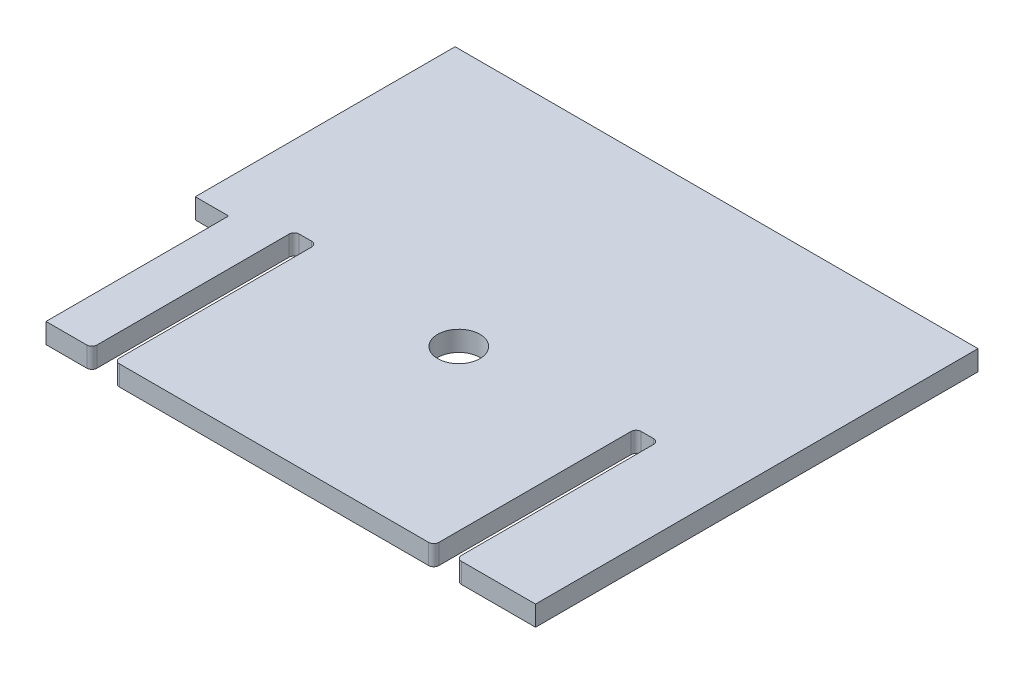
ISO-10303-21;
HEADER;
FILE_DESCRIPTION(('STEP AP214'),'2;1');
FILE_NAME('part.step','',(''),(''),'','','');
FILE_SCHEMA(('AUTOMOTIVE_DESIGN { 1 0 10303 214 1 1 1 1 }'));
ENDSEC;
DATA;
#1=APPLICATION_CONTEXT('core data for automotive mechanical design processes');
#2=APPLICATION_PROTOCOL_DEFINITION('international standard','automotive_design',2000,#1);
#3=PRODUCT_CONTEXT('',#1,'mechanical');
#4=PRODUCT('Part','Part','',(#3));
#5=PRODUCT_RELATED_PRODUCT_CATEGORY('part','',(#4));
#6=PRODUCT_DEFINITION_FORMATION('','',#4);
#7=PRODUCT_DEFINITION_CONTEXT('part definition',#1,'design');
#8=PRODUCT_DEFINITION('design','',#6,#7);
#9=PRODUCT_DEFINITION_SHAPE('','',#8);
#10=(LENGTH_UNIT() NAMED_UNIT(*) SI_UNIT(.MILLI.,.METRE.));
#11=(NAMED_UNIT(*) PLANE_ANGLE_UNIT() SI_UNIT($,.RADIAN.));
#12=(NAMED_UNIT(*) SI_UNIT($,.STERADIAN.) SOLID_ANGLE_UNIT());
#13=UNCERTAINTY_MEASURE_WITH_UNIT(LENGTH_MEASURE(1.E-05),#10,'distance_accuracy_value','');
#14=(GEOMETRIC_REPRESENTATION_CONTEXT(3) GLOBAL_UNCERTAINTY_ASSIGNED_CONTEXT((#13)) GLOBAL_UNIT_ASSIGNED_CONTEXT((#10,
#11,#12)) REPRESENTATION_CONTEXT('',''));
#15=CARTESIAN_POINT('',(0.,0.,0.));
#16=DIRECTION('',(0.,0.,1.));
#17=DIRECTION('',(1.,0.,0.));
#18=AXIS2_PLACEMENT_3D('',#15,#16,#17);
#19=CARTESIAN_POINT('',(799.161999999964,311.15,0.));
#20=DIRECTION('',(1.,0.,0.));
#21=DIRECTION('',(0.,0.,-1.));
#22=AXIS2_PLACEMENT_3D('',#19,#20,#21);
#23=PLANE('',#22);
#24=DIRECTION('',(0.,0.,1.));
#25=VECTOR('',#24,1.);
#26=CARTESIAN_POINT('',(799.161999999964,298.45,0.));
#27=LINE('',#26,#25);
#28=CARTESIAN_POINT('',(799.161999999964,298.45,-257.937));
#29=VERTEX_POINT('',#28);
#30=CARTESIAN_POINT('',(799.161999999964,298.45,-136.525));
#31=VERTEX_POINT('',#30);
#32=EDGE_CURVE('E270',#29,#31,#27,.T.);
#33=ORIENTED_EDGE('',*,*,#32,.T.);
#34=DIRECTION('',(0.,-1.,0.));
#35=VECTOR('',#34,1.);
#36=CARTESIAN_POINT('',(799.161999999964,311.15,-136.525));
#37=LINE('',#36,#35);
#38=CARTESIAN_POINT('',(799.161999999964,311.15,-136.525));
#39=VERTEX_POINT('',#38);
#40=EDGE_CURVE('E390',#31,#39,#37,.F.);
#41=ORIENTED_EDGE('',*,*,#40,.T.);
#42=DIRECTION('',(0.,0.,1.));
#43=VECTOR('',#42,1.);
#44=CARTESIAN_POINT('',(799.161999999964,311.15,0.));
#45=LINE('',#44,#43);
#46=CARTESIAN_POINT('',(799.161999999964,311.15,-257.937));
#47=VERTEX_POINT('',#46);
#48=EDGE_CURVE('E300',#47,#39,#45,.T.);
#49=ORIENTED_EDGE('',*,*,#48,.F.);
#50=DIRECTION('',(0.,-1.,0.));
#51=VECTOR('',#50,1.);
#52=CARTESIAN_POINT('',(799.161999999964,311.15,-257.937));
#53=LINE('',#52,#51);
#54=EDGE_CURVE('E386',#47,#29,#53,.T.);
#55=ORIENTED_EDGE('',*,*,#54,.T.);
#56=EDGE_LOOP('',(#33,#41,#49,#55));
#57=FACE_BOUND('',#56,.T.);
#58=ADVANCED_FACE('F46',(#57),#23,.F.);
#59=CARTESIAN_POINT('',(0.,311.15,-133.35));
#60=DIRECTION('',(0.,0.,1.));
#61=DIRECTION('',(1.,0.,0.));
#62=AXIS2_PLACEMENT_3D('',#59,#60,#61);
#63=PLANE('',#62);
#64=DIRECTION('',(-1.,0.,0.));
#65=VECTOR('',#64,1.);
#66=CARTESIAN_POINT('',(0.,298.45,-133.35));
#67=LINE('',#66,#65);
#68=CARTESIAN_POINT('',(997.662999999964,298.45,-133.35));
#69=VERTEX_POINT('',#68);
#70=CARTESIAN_POINT('',(802.336999999964,298.45,-133.35));
#71=VERTEX_POINT('',#70);
#72=EDGE_CURVE('E250',#69,#71,#67,.T.);
#73=ORIENTED_EDGE('',*,*,#72,.F.);
#74=DIRECTION('',(0.,-1.,0.));
#75=VECTOR('',#74,1.);
#76=CARTESIAN_POINT('',(997.662999999964,311.15,-133.35));
#77=LINE('',#76,#75);
#78=CARTESIAN_POINT('',(997.662999999964,311.15,-133.35));
#79=VERTEX_POINT('',#78);
#80=EDGE_CURVE('E383',#69,#79,#77,.F.);
#81=ORIENTED_EDGE('',*,*,#80,.T.);
#82=DIRECTION('',(-1.,0.,0.));
#83=VECTOR('',#82,1.);
#84=CARTESIAN_POINT('',(0.,311.15,-133.35));
#85=LINE('',#84,#83);
#86=CARTESIAN_POINT('',(802.336999999964,311.15,-133.35));
#87=VERTEX_POINT('',#86);
#88=EDGE_CURVE('E265',#79,#87,#85,.T.);
#89=ORIENTED_EDGE('',*,*,#88,.T.);
#90=DIRECTION('',(0.,-1.,0.));
#91=VECTOR('',#90,1.);
#92=CARTESIAN_POINT('',(802.336999999964,298.45,-133.35));
#93=LINE('',#92,#91);
#94=EDGE_CURVE('E379',#87,#71,#93,.T.);
#95=ORIENTED_EDGE('',*,*,#94,.T.);
#96=EDGE_LOOP('',(#73,#81,#89,#95));
#97=FACE_BOUND('',#96,.T.);
#98=ADVANCED_FACE('F456',(#97),#63,.T.);
#99=CARTESIAN_POINT('',(1000.83799999996,311.15,0.));
#100=DIRECTION('',(-1.,0.,0.));
#101=DIRECTION('',(0.,0.,1.));
#102=AXIS2_PLACEMENT_3D('',#99,#100,#101);
#103=PLANE('',#102);
#104=DIRECTION('',(0.,0.,-1.));
#105=VECTOR('',#104,1.);
#106=CARTESIAN_POINT('',(1000.83799999996,311.15,0.));
#107=LINE('',#106,#105);
#108=CARTESIAN_POINT('',(1000.83799999996,311.15,-136.525));
#109=VERTEX_POINT('',#108);
#110=CARTESIAN_POINT('',(1000.83799999996,311.15,-257.937));
#111=VERTEX_POINT('',#110);
#112=EDGE_CURVE('E297',#109,#111,#107,.T.);
#113=ORIENTED_EDGE('',*,*,#112,.F.);
#114=DIRECTION('',(0.,-1.,0.));
#115=VECTOR('',#114,1.);
#116=CARTESIAN_POINT('',(1000.83799999996,298.45,-136.525));
#117=LINE('',#116,#115);
#118=CARTESIAN_POINT('',(1000.83799999996,298.45,-136.525));
#119=VERTEX_POINT('',#118);
#120=EDGE_CURVE('E375',#109,#119,#117,.T.);
#121=ORIENTED_EDGE('',*,*,#120,.T.);
#122=DIRECTION('',(0.,0.,-1.));
#123=VECTOR('',#122,1.);
#124=CARTESIAN_POINT('',(1000.83799999996,298.45,0.));
#125=LINE('',#124,#123);
#126=CARTESIAN_POINT('',(1000.83799999996,298.45,-257.937));
#127=VERTEX_POINT('',#126);
#128=EDGE_CURVE('E269',#119,#127,#125,.T.);
#129=ORIENTED_EDGE('',*,*,#128,.T.);
#130=DIRECTION('',(0.,-1.,0.));
#131=VECTOR('',#130,1.);
#132=CARTESIAN_POINT('',(1000.83799999996,311.15,-257.937));
#133=LINE('',#132,#131);
#134=EDGE_CURVE('E372',#127,#111,#133,.F.);
#135=ORIENTED_EDGE('',*,*,#134,.T.);
#136=EDGE_LOOP('',(#113,#121,#129,#135));
#137=FACE_BOUND('',#136,.T.);
#138=ADVANCED_FACE('F463',(#137),#103,.F.);
#139=CARTESIAN_POINT('',(-2.28261853862925E-12,311.15,-261.111999999991));
#140=DIRECTION('',(0.,0.,1.));
#141=DIRECTION('',(1.,0.,0.));
#142=AXIS2_PLACEMENT_3D('',#139,#140,#141);
#143=PLANE('',#142);
#144=DIRECTION('',(-1.,0.,0.));
#145=VECTOR('',#144,1.);
#146=CARTESIAN_POINT('',(-2.28261853862925E-12,311.15,-261.111999999991));
#147=LINE('',#146,#145);
#148=CARTESIAN_POINT('',(1011.88699999996,311.15,-261.112));
#149=VERTEX_POINT('',#148);
#150=CARTESIAN_POINT('',(1004.01299999996,311.15,-261.112));
#151=VERTEX_POINT('',#150);
#152=EDGE_CURVE('E296',#149,#151,#147,.T.);
#153=ORIENTED_EDGE('',*,*,#152,.T.);
#154=DIRECTION('',(0.,-1.,0.));
#155=VECTOR('',#154,1.);
#156=CARTESIAN_POINT('',(1004.01299999996,311.15,-261.112));
#157=LINE('',#156,#155);
#158=CARTESIAN_POINT('',(1004.01299999996,298.45,-261.112));
#159=VERTEX_POINT('',#158);
#160=EDGE_CURVE('E405',#151,#159,#157,.T.);
#161=ORIENTED_EDGE('',*,*,#160,.T.);
#162=DIRECTION('',(-1.,0.,0.));
#163=VECTOR('',#162,1.);
#164=CARTESIAN_POINT('',(-2.28261853862925E-12,298.45,-261.111999999991));
#165=LINE('',#164,#163);
#166=CARTESIAN_POINT('',(1011.88699999996,298.45,-261.112));
#167=VERTEX_POINT('',#166);
#168=EDGE_CURVE('E254',#167,#159,#165,.T.);
#169=ORIENTED_EDGE('',*,*,#168,.F.);
#170=DIRECTION('',(0.,-1.,0.));
#171=VECTOR('',#170,1.);
#172=CARTESIAN_POINT('',(1011.88699999996,311.15,-261.112));
#173=LINE('',#172,#171);
#174=EDGE_CURVE('E69',#167,#149,#173,.F.);
#175=ORIENTED_EDGE('',*,*,#174,.T.);
#176=EDGE_LOOP('',(#153,#161,#169,#175));
#177=FACE_BOUND('',#176,.T.);
#178=ADVANCED_FACE('F469',(#177),#143,.T.);
#179=CARTESIAN_POINT('',(1015.06199999996,311.15,0.));
#180=DIRECTION('',(1.,0.,0.));
#181=DIRECTION('',(0.,0.,-1.));
#182=AXIS2_PLACEMENT_3D('',#179,#180,#181);
#183=PLANE('',#182);
#184=DIRECTION('',(0.,0.,1.));
#185=VECTOR('',#184,1.);
#186=CARTESIAN_POINT('',(1015.06199999996,298.45,0.));
#187=LINE('',#186,#185);
#188=CARTESIAN_POINT('',(1015.06199999996,298.45,-257.937));
#189=VERTEX_POINT('',#188);
#190=CARTESIAN_POINT('',(1015.06199999996,298.45,-136.525));
#191=VERTEX_POINT('',#190);
#192=EDGE_CURVE('E275',#189,#191,#187,.T.);
#193=ORIENTED_EDGE('',*,*,#192,.T.);
#194=DIRECTION('',(0.,-1.,0.));
#195=VECTOR('',#194,1.);
#196=CARTESIAN_POINT('',(1015.06199999996,311.15,-136.525));
#197=LINE('',#196,#195);
#198=CARTESIAN_POINT('',(1015.06199999996,311.15,-136.525));
#199=VERTEX_POINT('',#198);
#200=EDGE_CURVE('E357',#191,#199,#197,.F.);
#201=ORIENTED_EDGE('',*,*,#200,.T.);
#202=DIRECTION('',(0.,0.,1.));
#203=VECTOR('',#202,1.);
#204=CARTESIAN_POINT('',(1015.06199999996,311.15,0.));
#205=LINE('',#204,#203);
#206=CARTESIAN_POINT('',(1015.06199999996,311.15,-257.937));
#207=VERTEX_POINT('',#206);
#208=EDGE_CURVE('E283',#207,#199,#205,.T.);
#209=ORIENTED_EDGE('',*,*,#208,.F.);
#210=DIRECTION('',(0.,-1.,0.));
#211=VECTOR('',#210,1.);
#212=CARTESIAN_POINT('',(1015.06199999996,311.15,-257.937));
#213=LINE('',#212,#211);
#214=EDGE_CURVE('E353',#207,#189,#213,.T.);
#215=ORIENTED_EDGE('',*,*,#214,.T.);
#216=EDGE_LOOP('',(#193,#201,#209,#215));
#217=FACE_BOUND('',#216,.T.);
#218=ADVANCED_FACE('F477',(#217),#183,.F.);
#219=CARTESIAN_POINT('',(0.,311.15,-133.35));
#220=DIRECTION('',(0.,0.,1.));
#221=DIRECTION('',(1.,0.,0.));
#222=AXIS2_PLACEMENT_3D('',#219,#220,#221);
#223=PLANE('',#222);
#224=DIRECTION('',(-1.,0.,0.));
#225=VECTOR('',#224,1.);
#226=CARTESIAN_POINT('',(0.,311.15,-133.35));
#227=LINE('',#226,#225);
#228=CARTESIAN_POINT('',(1065.09999999996,311.15,-133.35));
#229=VERTEX_POINT('',#228);
#230=CARTESIAN_POINT('',(1018.23699999996,311.15,-133.35));
#231=VERTEX_POINT('',#230);
#232=EDGE_CURVE('E271',#229,#231,#227,.T.);
#233=ORIENTED_EDGE('',*,*,#232,.T.);
#234=DIRECTION('',(0.,-1.,0.));
#235=VECTOR('',#234,1.);
#236=CARTESIAN_POINT('',(1018.23699999996,298.45,-133.35));
#237=LINE('',#236,#235);
#238=CARTESIAN_POINT('',(1018.23699999996,298.45,-133.35));
#239=VERTEX_POINT('',#238);
#240=EDGE_CURVE('E338',#231,#239,#237,.T.);
#241=ORIENTED_EDGE('',*,*,#240,.T.);
#242=DIRECTION('',(-1.,0.,0.));
#243=VECTOR('',#242,1.);
#244=CARTESIAN_POINT('',(0.,298.45,-133.35));
#245=LINE('',#244,#243);
#246=CARTESIAN_POINT('',(1065.09999999996,298.45,-133.35));
#247=VERTEX_POINT('',#246);
#248=EDGE_CURVE('E255',#247,#239,#245,.T.);
#249=ORIENTED_EDGE('',*,*,#248,.F.);
#250=DIRECTION('',(0.,-1.,0.));
#251=VECTOR('',#250,1.);
#252=CARTESIAN_POINT('',(1065.09999999996,311.15,-133.35));
#253=LINE('',#252,#251);
#254=EDGE_CURVE('E246',#229,#247,#253,.T.);
#255=ORIENTED_EDGE('',*,*,#254,.F.);
#256=EDGE_LOOP('',(#233,#241,#249,#255));
#257=FACE_BOUND('',#256,.T.);
#258=ADVANCED_FACE('F486',(#257),#223,.T.);
#259=CARTESIAN_POINT('',(1065.09999999996,311.15,0.));
#260=DIRECTION('',(1.,0.,0.));
#261=DIRECTION('',(0.,0.,-1.));
#262=AXIS2_PLACEMENT_3D('',#259,#260,#261);
#263=PLANE('',#262);
#264=DIRECTION('',(0.,0.,1.));
#265=VECTOR('',#264,1.);
#266=CARTESIAN_POINT('',(1065.09999999996,298.45,0.));
#267=LINE('',#266,#265);
#268=CARTESIAN_POINT('',(1065.09999999996,298.45,-412.75));
#269=VERTEX_POINT('',#268);
#270=EDGE_CURVE('E258',#269,#247,#267,.T.);
#271=ORIENTED_EDGE('',*,*,#270,.F.);
#272=DIRECTION('',(0.,-1.,0.));
#273=VECTOR('',#272,1.);
#274=CARTESIAN_POINT('',(1065.09999999996,311.15,-412.75));
#275=LINE('',#274,#273);
#276=CARTESIAN_POINT('',(1065.09999999996,311.15,-412.75));
#277=VERTEX_POINT('',#276);
#278=EDGE_CURVE('E242',#277,#269,#275,.T.);
#279=ORIENTED_EDGE('',*,*,#278,.F.);
#280=DIRECTION('',(0.,0.,1.));
#281=VECTOR('',#280,1.);
#282=CARTESIAN_POINT('',(1065.09999999996,311.15,0.));
#283=LINE('',#282,#281);
#284=EDGE_CURVE('E249',#277,#229,#283,.T.);
#285=ORIENTED_EDGE('',*,*,#284,.T.);
#286=ORIENTED_EDGE('',*,*,#254,.T.);
#287=EDGE_LOOP('',(#271,#279,#285,#286));
#288=FACE_BOUND('',#287,.T.);
#289=ADVANCED_FACE('F491',(#288),#263,.T.);
#290=CARTESIAN_POINT('',(1.80411241501589E-12,311.15,-412.750000000003));
#291=DIRECTION('',(0.,0.,1.));
#292=DIRECTION('',(1.,0.,0.));
#293=AXIS2_PLACEMENT_3D('',#290,#291,#292);
#294=PLANE('',#293);
#295=DIRECTION('',(-1.,0.,0.));
#296=VECTOR('',#295,1.);
#297=CARTESIAN_POINT('',(1.80411241501589E-12,298.45,-412.750000000003));
#298=LINE('',#297,#296);
#299=CARTESIAN_POINT('',(734.899999999964,298.45,-412.75));
#300=VERTEX_POINT('',#299);
#301=EDGE_CURVE('E245',#269,#300,#298,.T.);
#302=ORIENTED_EDGE('',*,*,#301,.T.);
#303=DIRECTION('',(0.,-1.,0.));
#304=VECTOR('',#303,1.);
#305=CARTESIAN_POINT('',(734.899999999964,311.15,-412.75));
#306=LINE('',#305,#304);
#307=CARTESIAN_POINT('',(734.899999999964,311.15,-412.75));
#308=VERTEX_POINT('',#307);
#309=EDGE_CURVE('E237',#308,#300,#306,.T.);
#310=ORIENTED_EDGE('',*,*,#309,.F.);
#311=DIRECTION('',(-1.,0.,0.));
#312=VECTOR('',#311,1.);
#313=CARTESIAN_POINT('',(1.80411241501589E-12,311.15,-412.750000000003));
#314=LINE('',#313,#312);
#315=EDGE_CURVE('E279',#277,#308,#314,.T.);
#316=ORIENTED_EDGE('',*,*,#315,.F.);
#317=ORIENTED_EDGE('',*,*,#278,.T.);
#318=EDGE_LOOP('',(#302,#310,#316,#317));
#319=FACE_BOUND('',#318,.T.);
#320=ADVANCED_FACE('F498',(#319),#294,.F.);
#321=CARTESIAN_POINT('',(734.899999999964,311.15,0.));
#322=DIRECTION('',(1.,0.,0.));
#323=DIRECTION('',(0.,0.,-1.));
#324=AXIS2_PLACEMENT_3D('',#321,#322,#323);
#325=PLANE('',#324);
#326=DIRECTION('',(0.,0.,1.));
#327=VECTOR('',#326,1.);
#328=CARTESIAN_POINT('',(734.899999999964,298.45,0.));
#329=LINE('',#328,#327);
#330=CARTESIAN_POINT('',(734.899999999964,298.45,-248.675364530192));
#331=VERTEX_POINT('',#330);
#332=EDGE_CURVE('E241',#300,#331,#329,.T.);
#333=ORIENTED_EDGE('',*,*,#332,.T.);
#334=DIRECTION('',(0.,1.,0.));
#335=VECTOR('',#334,1.);
#336=CARTESIAN_POINT('',(734.899999999964,298.45,-248.675364530192));
#337=LINE('',#336,#335);
#338=CARTESIAN_POINT('',(734.899999999964,311.15,-248.675364530192));
#339=VERTEX_POINT('',#338);
#340=EDGE_CURVE('E232',#331,#339,#337,.T.);
#341=ORIENTED_EDGE('',*,*,#340,.T.);
#342=DIRECTION('',(0.,0.,1.));
#343=VECTOR('',#342,1.);
#344=CARTESIAN_POINT('',(734.899999999964,311.15,0.));
#345=LINE('',#344,#343);
#346=EDGE_CURVE('E282',#308,#339,#345,.T.);
#347=ORIENTED_EDGE('',*,*,#346,.F.);
#348=ORIENTED_EDGE('',*,*,#309,.T.);
#349=EDGE_LOOP('',(#333,#341,#347,#348));
#350=FACE_BOUND('',#349,.T.);
#351=ADVANCED_FACE('F501',(#350),#325,.F.);
#352=CARTESIAN_POINT('',(1.45716771982053E-13,311.15,-133.350000000001));
#353=DIRECTION('',(0.,0.,1.));
#354=DIRECTION('',(1.,0.,0.));
#355=AXIS2_PLACEMENT_3D('',#352,#353,#354);
#356=PLANE('',#355);
#357=DIRECTION('',(-1.,0.,0.));
#358=VECTOR('',#357,1.);
#359=CARTESIAN_POINT('',(1.45716771982053E-13,298.45,-133.350000000001));
#360=LINE('',#359,#358);
#361=CARTESIAN_POINT('',(781.762999999964,298.45,-133.35));
#362=VERTEX_POINT('',#361);
#363=CARTESIAN_POINT('',(755.968746235558,298.45,-133.35));
#364=VERTEX_POINT('',#363);
#365=EDGE_CURVE('E197',#362,#364,#360,.T.);
#366=ORIENTED_EDGE('',*,*,#365,.F.);
#367=DIRECTION('',(0.,-1.,0.));
#368=VECTOR('',#367,1.);
#369=CARTESIAN_POINT('',(781.762999999964,311.15,-133.35));
#370=LINE('',#369,#368);
#371=CARTESIAN_POINT('',(781.762999999964,311.15,-133.35));
#372=VERTEX_POINT('',#371);
#373=EDGE_CURVE('E400',#362,#372,#370,.F.);
#374=ORIENTED_EDGE('',*,*,#373,.T.);
#375=DIRECTION('',(-1.,0.,0.));
#376=VECTOR('',#375,1.);
#377=CARTESIAN_POINT('',(1.45716771982053E-13,311.15,-133.350000000001));
#378=LINE('',#377,#376);
#379=CARTESIAN_POINT('',(755.968746235558,311.15,-133.35));
#380=VERTEX_POINT('',#379);
#381=EDGE_CURVE('E227',#372,#380,#378,.T.);
#382=ORIENTED_EDGE('',*,*,#381,.T.);
#383=DIRECTION('',(0.,1.,0.));
#384=VECTOR('',#383,1.);
#385=CARTESIAN_POINT('',(755.968746235558,298.45,-133.35));
#386=LINE('',#385,#384);
#387=EDGE_CURVE('E218',#364,#380,#386,.T.);
#388=ORIENTED_EDGE('',*,*,#387,.F.);
#389=EDGE_LOOP('',(#366,#374,#382,#388));
#390=FACE_BOUND('',#389,.T.);
#391=ADVANCED_FACE('F225',(#390),#356,.T.);
#392=CARTESIAN_POINT('',(784.937999999964,311.15,0.));
#393=DIRECTION('',(-1.,0.,0.));
#394=DIRECTION('',(0.,0.,1.));
#395=AXIS2_PLACEMENT_3D('',#392,#393,#394);
#396=PLANE('',#395);
#397=DIRECTION('',(0.,0.,-1.));
#398=VECTOR('',#397,1.);
#399=CARTESIAN_POINT('',(784.937999999964,311.15,0.));
#400=LINE('',#399,#398);
#401=CARTESIAN_POINT('',(784.937999999964,311.15,-136.525));
#402=VERTEX_POINT('',#401);
#403=CARTESIAN_POINT('',(784.937999999964,311.15,-257.937));
#404=VERTEX_POINT('',#403);
#405=EDGE_CURVE('E316',#402,#404,#400,.T.);
#406=ORIENTED_EDGE('',*,*,#405,.F.);
#407=DIRECTION('',(0.,-1.,0.));
#408=VECTOR('',#407,1.);
#409=CARTESIAN_POINT('',(784.937999999964,298.45,-136.525));
#410=LINE('',#409,#408);
#411=CARTESIAN_POINT('',(784.937999999964,298.45,-136.525));
#412=VERTEX_POINT('',#411);
#413=EDGE_CURVE('E396',#402,#412,#410,.T.);
#414=ORIENTED_EDGE('',*,*,#413,.T.);
#415=DIRECTION('',(0.,0.,-1.));
#416=VECTOR('',#415,1.);
#417=CARTESIAN_POINT('',(784.937999999964,298.45,0.));
#418=LINE('',#417,#416);
#419=CARTESIAN_POINT('',(784.937999999964,298.45,-257.937));
#420=VERTEX_POINT('',#419);
#421=EDGE_CURVE('E286',#412,#420,#418,.T.);
#422=ORIENTED_EDGE('',*,*,#421,.T.);
#423=DIRECTION('',(0.,-1.,0.));
#424=VECTOR('',#423,1.);
#425=CARTESIAN_POINT('',(784.937999999964,311.15,-257.937));
#426=LINE('',#425,#424);
#427=EDGE_CURVE('E393',#420,#404,#426,.F.);
#428=ORIENTED_EDGE('',*,*,#427,.T.);
#429=EDGE_LOOP('',(#406,#414,#422,#428));
#430=FACE_BOUND('',#429,.T.);
#431=ADVANCED_FACE('F530',(#430),#396,.F.);
#432=CARTESIAN_POINT('',(0.,311.15,-261.112));
#433=DIRECTION('',(0.,0.,1.));
#434=DIRECTION('',(1.,0.,0.));
#435=AXIS2_PLACEMENT_3D('',#432,#433,#434);
#436=PLANE('',#435);
#437=DIRECTION('',(-1.,0.,0.));
#438=VECTOR('',#437,1.);
#439=CARTESIAN_POINT('',(0.,311.15,-261.112));
#440=LINE('',#439,#438);
#441=CARTESIAN_POINT('',(795.986999999964,311.15,-261.112));
#442=VERTEX_POINT('',#441);
#443=CARTESIAN_POINT('',(788.112999999964,311.15,-261.112));
#444=VERTEX_POINT('',#443);
#445=EDGE_CURVE('E315',#442,#444,#440,.T.);
#446=ORIENTED_EDGE('',*,*,#445,.T.);
#447=DIRECTION('',(0.,-1.,0.));
#448=VECTOR('',#447,1.);
#449=CARTESIAN_POINT('',(788.112999999964,311.15,-261.112));
#450=LINE('',#449,#448);
#451=CARTESIAN_POINT('',(788.112999999964,298.45,-261.112));
#452=VERTEX_POINT('',#451);
#453=EDGE_CURVE('E412',#444,#452,#450,.T.);
#454=ORIENTED_EDGE('',*,*,#453,.T.);
#455=DIRECTION('',(-1.,0.,0.));
#456=VECTOR('',#455,1.);
#457=CARTESIAN_POINT('',(0.,298.45,-261.112));
#458=LINE('',#457,#456);
#459=CARTESIAN_POINT('',(795.986999999964,298.45,-261.112));
#460=VERTEX_POINT('',#459);
#461=EDGE_CURVE('E211',#460,#452,#458,.T.);
#462=ORIENTED_EDGE('',*,*,#461,.F.);
#463=DIRECTION('',(0.,-1.,0.));
#464=VECTOR('',#463,1.);
#465=CARTESIAN_POINT('',(795.986999999964,311.15,-261.112));
#466=LINE('',#465,#464);
#467=EDGE_CURVE('E409',#460,#442,#466,.F.);
#468=ORIENTED_EDGE('',*,*,#467,.T.);
#469=EDGE_LOOP('',(#446,#454,#462,#468));
#470=FACE_BOUND('',#469,.T.);
#471=ADVANCED_FACE('F439',(#470),#436,.T.);
#472=CARTESIAN_POINT('',(0.,311.15,0.));
#473=DIRECTION('',(0.,-1.,0.));
#474=DIRECTION('',(0.,0.,-1.));
#475=AXIS2_PLACEMENT_3D('',#472,#473,#474);
#476=PLANE('',#475);
#477=ORIENTED_EDGE('',*,*,#208,.T.);
#478=CARTESIAN_POINT('',(1018.23699999996,311.15,-136.525));
#479=DIRECTION('',(0.,-1.,0.));
#480=DIRECTION('',(0.,0.,-1.));
#481=AXIS2_PLACEMENT_3D('',#478,#479,#480);
#482=CIRCLE('',#481,3.175);
#483=EDGE_CURVE('E369',#199,#231,#482,.F.);
#484=ORIENTED_EDGE('',*,*,#483,.T.);
#485=ORIENTED_EDGE('',*,*,#232,.F.);
#486=ORIENTED_EDGE('',*,*,#284,.F.);
#487=ORIENTED_EDGE('',*,*,#315,.T.);
#488=ORIENTED_EDGE('',*,*,#346,.T.);
#489=DIRECTION('',(-1.,0.,0.));
#490=VECTOR('',#489,1.);
#491=CARTESIAN_POINT('',(734.899999999964,311.15,-248.675364530192));
#492=LINE('',#491,#490);
#493=CARTESIAN_POINT('',(755.968746235558,311.15,-248.675364530192));
#494=VERTEX_POINT('',#493);
#495=EDGE_CURVE('E223',#494,#339,#492,.T.);
#496=ORIENTED_EDGE('',*,*,#495,.F.);
#497=DIRECTION('',(0.,0.,-1.));
#498=VECTOR('',#497,1.);
#499=CARTESIAN_POINT('',(755.968746235558,311.15,-133.35));
#500=LINE('',#499,#498);
#501=EDGE_CURVE('E507',#380,#494,#500,.T.);
#502=ORIENTED_EDGE('',*,*,#501,.F.);
#503=ORIENTED_EDGE('',*,*,#381,.F.);
#504=CARTESIAN_POINT('',(781.762999999964,311.15,-136.525));
#505=DIRECTION('',(0.,-1.,0.));
#506=DIRECTION('',(0.,0.,-1.));
#507=AXIS2_PLACEMENT_3D('',#504,#505,#506);
#508=CIRCLE('',#507,3.175);
#509=EDGE_CURVE('E360',#372,#402,#508,.F.);
#510=ORIENTED_EDGE('',*,*,#509,.T.);
#511=ORIENTED_EDGE('',*,*,#405,.T.);
#512=CARTESIAN_POINT('',(788.112999999964,311.15,-257.937));
#513=DIRECTION('',(0.,-1.,0.));
#514=DIRECTION('',(0.,0.,-1.));
#515=AXIS2_PLACEMENT_3D('',#512,#513,#514);
#516=CIRCLE('',#515,3.175);
#517=EDGE_CURVE('E430',#404,#444,#516,.T.);
#518=ORIENTED_EDGE('',*,*,#517,.T.);
#519=ORIENTED_EDGE('',*,*,#445,.F.);
#520=CARTESIAN_POINT('',(795.986999999964,311.15,-257.937));
#521=DIRECTION('',(0.,-1.,0.));
#522=DIRECTION('',(0.,0.,-1.));
#523=AXIS2_PLACEMENT_3D('',#520,#521,#522);
#524=CIRCLE('',#523,3.175);
#525=EDGE_CURVE('E12',#442,#47,#524,.T.);
#526=ORIENTED_EDGE('',*,*,#525,.T.);
#527=ORIENTED_EDGE('',*,*,#48,.T.);
#528=CARTESIAN_POINT('',(802.336999999964,311.15,-136.525));
#529=DIRECTION('',(0.,-1.,0.));
#530=DIRECTION('',(0.,0.,-1.));
#531=AXIS2_PLACEMENT_3D('',#528,#529,#530);
#532=CIRCLE('',#531,3.175);
#533=EDGE_CURVE('E363',#39,#87,#532,.F.);
#534=ORIENTED_EDGE('',*,*,#533,.T.);
#535=ORIENTED_EDGE('',*,*,#88,.F.);
#536=CARTESIAN_POINT('',(997.662999999964,311.15,-136.525));
#537=DIRECTION('',(0.,-1.,0.));
#538=DIRECTION('',(0.,0.,-1.));
#539=AXIS2_PLACEMENT_3D('',#536,#537,#538);
#540=CIRCLE('',#539,3.175);
#541=EDGE_CURVE('E366',#79,#109,#540,.F.);
#542=ORIENTED_EDGE('',*,*,#541,.T.);
#543=ORIENTED_EDGE('',*,*,#112,.T.);
#544=CARTESIAN_POINT('',(1004.01299999996,311.15,-257.937));
#545=DIRECTION('',(0.,-1.,0.));
#546=DIRECTION('',(0.,0.,-1.));
#547=AXIS2_PLACEMENT_3D('',#544,#545,#546);
#548=CIRCLE('',#547,3.175);
#549=EDGE_CURVE('E62',#111,#151,#548,.T.);
#550=ORIENTED_EDGE('',*,*,#549,.T.);
#551=ORIENTED_EDGE('',*,*,#152,.F.);
#552=CARTESIAN_POINT('',(1011.88699999996,311.15,-257.937));
#553=DIRECTION('',(0.,-1.,0.));
#554=DIRECTION('',(0.,0.,-1.));
#555=AXIS2_PLACEMENT_3D('',#552,#553,#554);
#556=CIRCLE('',#555,3.175);
#557=EDGE_CURVE('E424',#149,#207,#556,.T.);
#558=ORIENTED_EDGE('',*,*,#557,.T.);
#559=EDGE_LOOP('',(#477,#484,#485,#486,#487,#488,#496,#502,#503,#510,#511,#518,#519,#526,#527,
#534,#535,#542,#543,#550,#551,#558));
#560=FACE_BOUND('',#559,.T.);
#561=CARTESIAN_POINT('',(899.999999999999,311.15,-249.999999999998));
#562=DIRECTION('',(0.,-1.,0.));
#563=DIRECTION('',(0.,0.,-1.));
#564=AXIS2_PLACEMENT_3D('',#561,#562,#563);
#565=CIRCLE('',#564,13.335);
#566=CARTESIAN_POINT('',(899.999999999999,311.15,-263.334999999998));
#567=VERTEX_POINT('',#566);
#568=EDGE_CURVE('E210',#567,#567,#565,.F.);
#569=ORIENTED_EDGE('',*,*,#568,.F.);
#570=EDGE_LOOP('',(#569));
#571=FACE_BOUND('',#570,.T.);
#572=ADVANCED_FACE('F444',(#560,#571),#476,.F.);
#573=CARTESIAN_POINT('',(0.,298.45,0.));
#574=DIRECTION('',(0.,-1.,0.));
#575=DIRECTION('',(0.,0.,-1.));
#576=AXIS2_PLACEMENT_3D('',#573,#574,#575);
#577=PLANE('',#576);
#578=ORIENTED_EDGE('',*,*,#248,.T.);
#579=CARTESIAN_POINT('',(1018.23699999996,298.45,-136.525));
#580=DIRECTION('',(0.,-1.,0.));
#581=DIRECTION('',(0.,0.,-1.));
#582=AXIS2_PLACEMENT_3D('',#579,#580,#581);
#583=CIRCLE('',#582,3.175);
#584=EDGE_CURVE('E350',#239,#191,#583,.T.);
#585=ORIENTED_EDGE('',*,*,#584,.T.);
#586=ORIENTED_EDGE('',*,*,#192,.F.);
#587=CARTESIAN_POINT('',(1011.88699999996,298.45,-257.937));
#588=DIRECTION('',(0.,-1.,0.));
#589=DIRECTION('',(0.,0.,-1.));
#590=AXIS2_PLACEMENT_3D('',#587,#588,#589);
#591=CIRCLE('',#590,3.175);
#592=EDGE_CURVE('E421',#189,#167,#591,.F.);
#593=ORIENTED_EDGE('',*,*,#592,.T.);
#594=ORIENTED_EDGE('',*,*,#168,.T.);
#595=CARTESIAN_POINT('',(1004.01299999996,298.45,-257.937));
#596=DIRECTION('',(0.,-1.,0.));
#597=DIRECTION('',(0.,0.,-1.));
#598=AXIS2_PLACEMENT_3D('',#595,#596,#597);
#599=CIRCLE('',#598,3.175);
#600=EDGE_CURVE('E416',#159,#127,#599,.F.);
#601=ORIENTED_EDGE('',*,*,#600,.T.);
#602=ORIENTED_EDGE('',*,*,#128,.F.);
#603=CARTESIAN_POINT('',(997.662999999964,298.45,-136.525));
#604=DIRECTION('',(0.,-1.,0.));
#605=DIRECTION('',(0.,0.,-1.));
#606=AXIS2_PLACEMENT_3D('',#603,#604,#605);
#607=CIRCLE('',#606,3.175);
#608=EDGE_CURVE('E347',#119,#69,#607,.T.);
#609=ORIENTED_EDGE('',*,*,#608,.T.);
#610=ORIENTED_EDGE('',*,*,#72,.T.);
#611=CARTESIAN_POINT('',(802.336999999964,298.45,-136.525));
#612=DIRECTION('',(0.,-1.,0.));
#613=DIRECTION('',(0.,0.,-1.));
#614=AXIS2_PLACEMENT_3D('',#611,#612,#613);
#615=CIRCLE('',#614,3.175);
#616=EDGE_CURVE('E344',#71,#31,#615,.T.);
#617=ORIENTED_EDGE('',*,*,#616,.T.);
#618=ORIENTED_EDGE('',*,*,#32,.F.);
#619=CARTESIAN_POINT('',(795.986999999964,298.45,-257.937));
#620=DIRECTION('',(0.,-1.,0.));
#621=DIRECTION('',(0.,0.,-1.));
#622=AXIS2_PLACEMENT_3D('',#619,#620,#621);
#623=CIRCLE('',#622,3.175);
#624=EDGE_CURVE('E55',#29,#460,#623,.F.);
#625=ORIENTED_EDGE('',*,*,#624,.T.);
#626=ORIENTED_EDGE('',*,*,#461,.T.);
#627=CARTESIAN_POINT('',(788.112999999964,298.45,-257.937));
#628=DIRECTION('',(0.,-1.,0.));
#629=DIRECTION('',(0.,0.,-1.));
#630=AXIS2_PLACEMENT_3D('',#627,#628,#629);
#631=CIRCLE('',#630,3.175);
#632=EDGE_CURVE('E427',#452,#420,#631,.F.);
#633=ORIENTED_EDGE('',*,*,#632,.T.);
#634=ORIENTED_EDGE('',*,*,#421,.F.);
#635=CARTESIAN_POINT('',(781.762999999964,298.45,-136.525));
#636=DIRECTION('',(0.,-1.,0.));
#637=DIRECTION('',(0.,0.,-1.));
#638=AXIS2_PLACEMENT_3D('',#635,#636,#637);
#639=CIRCLE('',#638,3.175);
#640=EDGE_CURVE('E205',#412,#362,#639,.T.);
#641=ORIENTED_EDGE('',*,*,#640,.T.);
#642=ORIENTED_EDGE('',*,*,#365,.T.);
#643=DIRECTION('',(0.,0.,-1.));
#644=VECTOR('',#643,1.);
#645=CARTESIAN_POINT('',(755.968746235558,298.45,-133.35));
#646=LINE('',#645,#644);
#647=CARTESIAN_POINT('',(755.968746235558,298.45,-248.675364530192));
#648=VERTEX_POINT('',#647);
#649=EDGE_CURVE('E203',#364,#648,#646,.T.);
#650=ORIENTED_EDGE('',*,*,#649,.T.);
#651=DIRECTION('',(-1.,0.,0.));
#652=VECTOR('',#651,1.);
#653=CARTESIAN_POINT('',(734.899999999964,298.45,-248.675364530192));
#654=LINE('',#653,#652);
#655=EDGE_CURVE('E222',#648,#331,#654,.T.);
#656=ORIENTED_EDGE('',*,*,#655,.T.);
#657=ORIENTED_EDGE('',*,*,#332,.F.);
#658=ORIENTED_EDGE('',*,*,#301,.F.);
#659=ORIENTED_EDGE('',*,*,#270,.T.);
#660=EDGE_LOOP('',(#578,#585,#586,#593,#594,#601,#602,#609,#610,#617,#618,#625,#626,#633,#634,
#641,#642,#650,#656,#657,#658,#659));
#661=FACE_BOUND('',#660,.T.);
#662=CARTESIAN_POINT('',(899.999999999999,298.45,-249.999999999998));
#663=DIRECTION('',(0.,-1.,0.));
#664=DIRECTION('',(0.,0.,-1.));
#665=AXIS2_PLACEMENT_3D('',#662,#663,#664);
#666=CIRCLE('',#665,13.335);
#667=CARTESIAN_POINT('',(899.999999999999,298.45,-263.334999999998));
#668=VERTEX_POINT('',#667);
#669=EDGE_CURVE('E262',#668,#668,#666,.F.);
#670=ORIENTED_EDGE('',*,*,#669,.T.);
#671=EDGE_LOOP('',(#670));
#672=FACE_BOUND('',#671,.T.);
#673=ADVANCED_FACE('F200',(#661,#672),#577,.T.);
#674=CARTESIAN_POINT('',(899.999999999999,420.499546279127,-249.999999999998));
#675=DIRECTION('',(0.,-1.,0.));
#676=DIRECTION('',(0.,0.,-1.));
#677=AXIS2_PLACEMENT_3D('',#674,#675,#676);
#678=CYLINDRICAL_SURFACE('',#677,13.335);
#679=ORIENTED_EDGE('',*,*,#669,.F.);
#680=EDGE_LOOP('',(#679));
#681=FACE_BOUND('',#680,.T.);
#682=ORIENTED_EDGE('',*,*,#568,.T.);
#683=EDGE_LOOP('',(#682));
#684=FACE_BOUND('',#683,.T.);
#685=ADVANCED_FACE('F511',(#681,#684),#678,.F.);
#686=CARTESIAN_POINT('',(734.899999999964,298.45,-248.675364530192));
#687=DIRECTION('',(0.,0.,-1.));
#688=DIRECTION('',(-1.,0.,0.));
#689=AXIS2_PLACEMENT_3D('',#686,#687,#688);
#690=PLANE('',#689);
#691=ORIENTED_EDGE('',*,*,#495,.T.);
#692=ORIENTED_EDGE('',*,*,#340,.F.);
#693=ORIENTED_EDGE('',*,*,#655,.F.);
#694=DIRECTION('',(0.,1.,0.));
#695=VECTOR('',#694,1.);
#696=CARTESIAN_POINT('',(755.968746235558,298.45,-248.675364530192));
#697=LINE('',#696,#695);
#698=EDGE_CURVE('E220',#648,#494,#697,.T.);
#699=ORIENTED_EDGE('',*,*,#698,.T.);
#700=EDGE_LOOP('',(#691,#692,#693,#699));
#701=FACE_BOUND('',#700,.T.);
#702=ADVANCED_FACE('F509',(#701),#690,.F.);
#703=CARTESIAN_POINT('',(755.968746235558,298.45,-133.35));
#704=DIRECTION('',(1.,0.,0.));
#705=DIRECTION('',(0.,0.,-1.));
#706=AXIS2_PLACEMENT_3D('',#703,#704,#705);
#707=PLANE('',#706);
#708=ORIENTED_EDGE('',*,*,#501,.T.);
#709=ORIENTED_EDGE('',*,*,#698,.F.);
#710=ORIENTED_EDGE('',*,*,#649,.F.);
#711=ORIENTED_EDGE('',*,*,#387,.T.);
#712=EDGE_LOOP('',(#708,#709,#710,#711));
#713=FACE_BOUND('',#712,.T.);
#714=ADVANCED_FACE('F217',(#713),#707,.F.);
#715=CARTESIAN_POINT('',(1018.23699999996,311.15,-136.525));
#716=DIRECTION('',(0.,1.,0.));
#717=DIRECTION('',(0.,0.,1.));
#718=AXIS2_PLACEMENT_3D('',#715,#716,#717);
#719=CYLINDRICAL_SURFACE('',#718,3.175);
#720=ORIENTED_EDGE('',*,*,#483,.F.);
#721=ORIENTED_EDGE('',*,*,#200,.F.);
#722=ORIENTED_EDGE('',*,*,#584,.F.);
#723=ORIENTED_EDGE('',*,*,#240,.F.);
#724=EDGE_LOOP('',(#720,#721,#722,#723));
#725=FACE_BOUND('',#724,.T.);
#726=ADVANCED_FACE('F483',(#725),#719,.T.);
#727=CARTESIAN_POINT('',(997.662999999964,311.15,-136.525));
#728=DIRECTION('',(0.,1.,0.));
#729=DIRECTION('',(0.,0.,1.));
#730=AXIS2_PLACEMENT_3D('',#727,#728,#729);
#731=CYLINDRICAL_SURFACE('',#730,3.175);
#732=ORIENTED_EDGE('',*,*,#541,.F.);
#733=ORIENTED_EDGE('',*,*,#80,.F.);
#734=ORIENTED_EDGE('',*,*,#608,.F.);
#735=ORIENTED_EDGE('',*,*,#120,.F.);
#736=EDGE_LOOP('',(#732,#733,#734,#735));
#737=FACE_BOUND('',#736,.T.);
#738=ADVANCED_FACE('F459',(#737),#731,.T.);
#739=CARTESIAN_POINT('',(802.336999999964,311.15,-136.525));
#740=DIRECTION('',(0.,1.,0.));
#741=DIRECTION('',(0.,0.,1.));
#742=AXIS2_PLACEMENT_3D('',#739,#740,#741);
#743=CYLINDRICAL_SURFACE('',#742,3.175);
#744=ORIENTED_EDGE('',*,*,#533,.F.);
#745=ORIENTED_EDGE('',*,*,#40,.F.);
#746=ORIENTED_EDGE('',*,*,#616,.F.);
#747=ORIENTED_EDGE('',*,*,#94,.F.);
#748=EDGE_LOOP('',(#744,#745,#746,#747));
#749=FACE_BOUND('',#748,.T.);
#750=ADVANCED_FACE('F450',(#749),#743,.T.);
#751=CARTESIAN_POINT('',(781.762999999964,311.15,-136.525));
#752=DIRECTION('',(0.,1.,0.));
#753=DIRECTION('',(0.,0.,1.));
#754=AXIS2_PLACEMENT_3D('',#751,#752,#753);
#755=CYLINDRICAL_SURFACE('',#754,3.175);
#756=ORIENTED_EDGE('',*,*,#509,.F.);
#757=ORIENTED_EDGE('',*,*,#373,.F.);
#758=ORIENTED_EDGE('',*,*,#640,.F.);
#759=ORIENTED_EDGE('',*,*,#413,.F.);
#760=EDGE_LOOP('',(#756,#757,#758,#759));
#761=FACE_BOUND('',#760,.T.);
#762=ADVANCED_FACE('F538',(#761),#755,.T.);
#763=CARTESIAN_POINT('',(1004.01299999996,311.15,-257.937));
#764=DIRECTION('',(0.,-1.,0.));
#765=DIRECTION('',(0.,0.,-1.));
#766=AXIS2_PLACEMENT_3D('',#763,#764,#765);
#767=CYLINDRICAL_SURFACE('',#766,3.175);
#768=ORIENTED_EDGE('',*,*,#549,.F.);
#769=ORIENTED_EDGE('',*,*,#134,.F.);
#770=ORIENTED_EDGE('',*,*,#600,.F.);
#771=ORIENTED_EDGE('',*,*,#160,.F.);
#772=EDGE_LOOP('',(#768,#769,#770,#771));
#773=FACE_BOUND('',#772,.T.);
#774=ADVANCED_FACE('F467',(#773),#767,.F.);
#775=CARTESIAN_POINT('',(1011.88699999996,311.15,-257.937));
#776=DIRECTION('',(0.,-1.,0.));
#777=DIRECTION('',(0.,0.,-1.));
#778=AXIS2_PLACEMENT_3D('',#775,#776,#777);
#779=CYLINDRICAL_SURFACE('',#778,3.175);
#780=ORIENTED_EDGE('',*,*,#557,.F.);
#781=ORIENTED_EDGE('',*,*,#174,.F.);
#782=ORIENTED_EDGE('',*,*,#592,.F.);
#783=ORIENTED_EDGE('',*,*,#214,.F.);
#784=EDGE_LOOP('',(#780,#781,#782,#783));
#785=FACE_BOUND('',#784,.T.);
#786=ADVANCED_FACE('F474',(#785),#779,.F.);
#787=CARTESIAN_POINT('',(788.112999999964,311.15,-257.937));
#788=DIRECTION('',(0.,-1.,0.));
#789=DIRECTION('',(0.,0.,-1.));
#790=AXIS2_PLACEMENT_3D('',#787,#788,#789);
#791=CYLINDRICAL_SURFACE('',#790,3.175);
#792=ORIENTED_EDGE('',*,*,#517,.F.);
#793=ORIENTED_EDGE('',*,*,#427,.F.);
#794=ORIENTED_EDGE('',*,*,#632,.F.);
#795=ORIENTED_EDGE('',*,*,#453,.F.);
#796=EDGE_LOOP('',(#792,#793,#794,#795));
#797=FACE_BOUND('',#796,.T.);
#798=ADVANCED_FACE('F545',(#797),#791,.F.);
#799=CARTESIAN_POINT('',(795.986999999964,311.15,-257.937));
#800=DIRECTION('',(0.,-1.,0.));
#801=DIRECTION('',(0.,0.,-1.));
#802=AXIS2_PLACEMENT_3D('',#799,#800,#801);
#803=CYLINDRICAL_SURFACE('',#802,3.175);
#804=ORIENTED_EDGE('',*,*,#525,.F.);
#805=ORIENTED_EDGE('',*,*,#467,.F.);
#806=ORIENTED_EDGE('',*,*,#624,.F.);
#807=ORIENTED_EDGE('',*,*,#54,.F.);
#808=EDGE_LOOP('',(#804,#805,#806,#807));
#809=FACE_BOUND('',#808,.T.);
#810=ADVANCED_FACE('F48',(#809),#803,.F.);
#811=CLOSED_SHELL('',(#58,#98,#138,#178,#218,#258,#289,#320,#351,#391,#431,#471,#572,#673,#685,
#702,#714,#726,#738,#750,#762,#774,#786,#798,#810));
#812=MANIFOLD_SOLID_BREP('B2',#811);
#813=ADVANCED_BREP_SHAPE_REPRESENTATION('',(#18,#812),#14);
#814=SHAPE_DEFINITION_REPRESENTATION(#9,#813);
ENDSEC;
END-ISO-10303-21;
